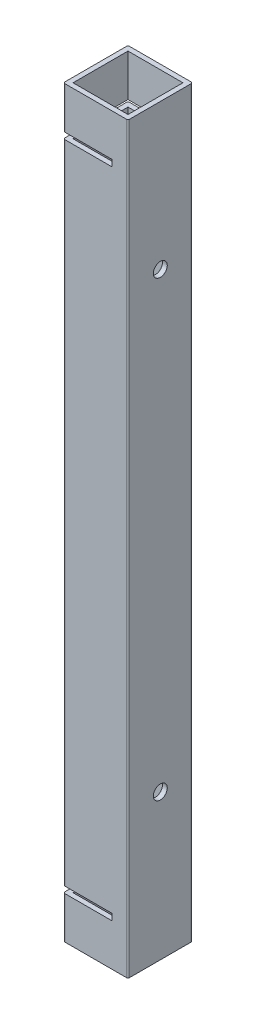
ISO-10303-21;
HEADER;
FILE_DESCRIPTION(('STEP AP214'),'2;1');
FILE_NAME('part.step','',(''),(''),'','','');
FILE_SCHEMA(('AUTOMOTIVE_DESIGN { 1 0 10303 214 1 1 1 1 }'));
ENDSEC;
DATA;
#1=APPLICATION_CONTEXT('core data for automotive mechanical design processes');
#2=APPLICATION_PROTOCOL_DEFINITION('international standard','automotive_design',2000,#1);
#3=PRODUCT_CONTEXT('',#1,'mechanical');
#4=PRODUCT('Part','Part','',(#3));
#5=PRODUCT_RELATED_PRODUCT_CATEGORY('part','',(#4));
#6=PRODUCT_DEFINITION_FORMATION('','',#4);
#7=PRODUCT_DEFINITION_CONTEXT('part definition',#1,'design');
#8=PRODUCT_DEFINITION('design','',#6,#7);
#9=PRODUCT_DEFINITION_SHAPE('','',#8);
#10=(LENGTH_UNIT() NAMED_UNIT(*) SI_UNIT(.MILLI.,.METRE.));
#11=(NAMED_UNIT(*) PLANE_ANGLE_UNIT() SI_UNIT($,.RADIAN.));
#12=(NAMED_UNIT(*) SI_UNIT($,.STERADIAN.) SOLID_ANGLE_UNIT());
#13=UNCERTAINTY_MEASURE_WITH_UNIT(LENGTH_MEASURE(1.E-05),#10,'distance_accuracy_value','');
#14=(GEOMETRIC_REPRESENTATION_CONTEXT(3) GLOBAL_UNCERTAINTY_ASSIGNED_CONTEXT((#13)) GLOBAL_UNIT_ASSIGNED_CONTEXT((#10,
#11,#12)) REPRESENTATION_CONTEXT('',''));
#15=CARTESIAN_POINT('',(0.,0.,0.));
#16=DIRECTION('',(0.,0.,1.));
#17=DIRECTION('',(1.,0.,0.));
#18=AXIS2_PLACEMENT_3D('',#15,#16,#17);
#19=CARTESIAN_POINT('',(0.5,230.,-19.5));
#20=DIRECTION('',(0.,-1.,0.));
#21=DIRECTION('',(0.,0.,-1.));
#22=AXIS2_PLACEMENT_3D('',#19,#20,#21);
#23=CYLINDRICAL_SURFACE('',#22,0.5);
#24=DIRECTION('',(0.,-1.,0.));
#25=VECTOR('',#24,1.);
#26=CARTESIAN_POINT('',(0.,230.,-19.5));
#27=LINE('',#26,#25);
#28=CARTESIAN_POINT('',(0.,13.,-19.5));
#29=VERTEX_POINT('',#28);
#30=CARTESIAN_POINT('',(0.,0.,-19.5));
#31=VERTEX_POINT('',#30);
#32=EDGE_CURVE('E503',#29,#31,#27,.T.);
#33=ORIENTED_EDGE('',*,*,#32,.F.);
#34=CARTESIAN_POINT('',(0.5,13.,-19.5));
#35=DIRECTION('',(0.,-1.,0.));
#36=DIRECTION('',(0.,0.,-1.));
#37=AXIS2_PLACEMENT_3D('',#34,#35,#36);
#38=CIRCLE('',#37,0.5);
#39=CARTESIAN_POINT('',(0.5,13.,-20.));
#40=VERTEX_POINT('',#39);
#41=EDGE_CURVE('E384',#29,#40,#38,.T.);
#42=ORIENTED_EDGE('',*,*,#41,.T.);
#43=DIRECTION('',(0.,-1.,0.));
#44=VECTOR('',#43,1.);
#45=CARTESIAN_POINT('',(0.5,230.,-20.));
#46=LINE('',#45,#44);
#47=CARTESIAN_POINT('',(0.5,0.,-20.));
#48=VERTEX_POINT('',#47);
#49=EDGE_CURVE('E509',#40,#48,#46,.T.);
#50=ORIENTED_EDGE('',*,*,#49,.T.);
#51=CARTESIAN_POINT('',(0.5,0.,-19.5));
#52=DIRECTION('',(0.,1.,0.));
#53=DIRECTION('',(0.,0.,-1.));
#54=AXIS2_PLACEMENT_3D('',#51,#52,#53);
#55=CIRCLE('',#54,0.5);
#56=EDGE_CURVE('E476',#48,#31,#55,.T.);
#57=ORIENTED_EDGE('',*,*,#56,.T.);
#58=EDGE_LOOP('',(#33,#42,#50,#57));
#59=FACE_BOUND('',#58,.T.);
#60=ADVANCED_FACE('F39',(#59),#23,.T.);
#61=CARTESIAN_POINT('',(0.5,230.,-20.));
#62=VERTEX_POINT('',#61);
#63=CARTESIAN_POINT('',(0.5,217.,-20.));
#64=VERTEX_POINT('',#63);
#65=EDGE_CURVE('E511',#62,#64,#46,.T.);
#66=ORIENTED_EDGE('',*,*,#65,.T.);
#67=CARTESIAN_POINT('',(0.5,217.,-19.5));
#68=DIRECTION('',(0.,1.,0.));
#69=DIRECTION('',(0.,0.,1.));
#70=AXIS2_PLACEMENT_3D('',#67,#68,#69);
#71=CIRCLE('',#70,0.5);
#72=CARTESIAN_POINT('',(0.,217.,-19.5));
#73=VERTEX_POINT('',#72);
#74=EDGE_CURVE('E355',#64,#73,#71,.T.);
#75=ORIENTED_EDGE('',*,*,#74,.T.);
#76=CARTESIAN_POINT('',(0.,230.,-19.5));
#77=VERTEX_POINT('',#76);
#78=EDGE_CURVE('E505',#77,#73,#27,.T.);
#79=ORIENTED_EDGE('',*,*,#78,.F.);
#80=CARTESIAN_POINT('',(0.5,230.,-19.5));
#81=DIRECTION('',(0.,1.,0.));
#82=DIRECTION('',(0.,0.,-1.));
#83=AXIS2_PLACEMENT_3D('',#80,#81,#82);
#84=CIRCLE('',#83,0.5);
#85=EDGE_CURVE('E450',#62,#77,#84,.T.);
#86=ORIENTED_EDGE('',*,*,#85,.F.);
#87=EDGE_LOOP('',(#66,#75,#79,#86));
#88=FACE_BOUND('',#87,.T.);
#89=ADVANCED_FACE('F655',(#88),#23,.T.);
#90=CARTESIAN_POINT('',(0.,230.,-0.500000000000004));
#91=DIRECTION('',(1.,0.,0.));
#92=DIRECTION('',(0.,0.,-1.));
#93=AXIS2_PLACEMENT_3D('',#90,#91,#92);
#94=PLANE('',#93);
#95=DIRECTION('',(0.,-1.,0.));
#96=VECTOR('',#95,1.);
#97=CARTESIAN_POINT('',(0.,230.,-0.500000000000003));
#98=LINE('',#97,#96);
#99=CARTESIAN_POINT('',(0.,13.,-0.5));
#100=VERTEX_POINT('',#99);
#101=CARTESIAN_POINT('',(0.,0.,-0.500000000000003));
#102=VERTEX_POINT('',#101);
#103=EDGE_CURVE('E498',#100,#102,#98,.T.);
#104=ORIENTED_EDGE('',*,*,#103,.F.);
#105=DIRECTION('',(0.,0.,1.));
#106=VECTOR('',#105,1.);
#107=CARTESIAN_POINT('',(0.,13.,-20.));
#108=LINE('',#107,#106);
#109=EDGE_CURVE('E273',#29,#100,#108,.T.);
#110=ORIENTED_EDGE('',*,*,#109,.F.);
#111=ORIENTED_EDGE('',*,*,#32,.T.);
#112=DIRECTION('',(0.,0.,1.));
#113=VECTOR('',#112,1.);
#114=CARTESIAN_POINT('',(0.,0.,-0.500000000000004));
#115=LINE('',#114,#113);
#116=EDGE_CURVE('E480',#31,#102,#115,.T.);
#117=ORIENTED_EDGE('',*,*,#116,.T.);
#118=EDGE_LOOP('',(#104,#110,#111,#117));
#119=FACE_BOUND('',#118,.T.);
#120=ADVANCED_FACE('F624',(#119),#94,.F.);
#121=ORIENTED_EDGE('',*,*,#78,.T.);
#122=DIRECTION('',(0.,0.,-1.));
#123=VECTOR('',#122,1.);
#124=CARTESIAN_POINT('',(0.,217.,-20.));
#125=LINE('',#124,#123);
#126=CARTESIAN_POINT('',(0.,217.,-0.5));
#127=VERTEX_POINT('',#126);
#128=EDGE_CURVE('E309',#127,#73,#125,.T.);
#129=ORIENTED_EDGE('',*,*,#128,.F.);
#130=CARTESIAN_POINT('',(0.,230.,-0.500000000000003));
#131=VERTEX_POINT('',#130);
#132=EDGE_CURVE('E499',#131,#127,#98,.T.);
#133=ORIENTED_EDGE('',*,*,#132,.F.);
#134=DIRECTION('',(0.,0.,1.));
#135=VECTOR('',#134,1.);
#136=CARTESIAN_POINT('',(0.,230.,-0.500000000000004));
#137=LINE('',#136,#135);
#138=EDGE_CURVE('E453',#77,#131,#137,.T.);
#139=ORIENTED_EDGE('',*,*,#138,.F.);
#140=EDGE_LOOP('',(#121,#129,#133,#139));
#141=FACE_BOUND('',#140,.T.);
#142=ADVANCED_FACE('F650',(#141),#94,.F.);
#143=CARTESIAN_POINT('',(0.5,230.,-0.5));
#144=DIRECTION('',(0.,-1.,0.));
#145=DIRECTION('',(0.,0.,-1.));
#146=AXIS2_PLACEMENT_3D('',#143,#144,#145);
#147=CYLINDRICAL_SURFACE('',#146,0.5);
#148=DIRECTION('',(0.,-1.,0.));
#149=VECTOR('',#148,1.);
#150=CARTESIAN_POINT('',(0.500000000000004,230.,0.));
#151=LINE('',#150,#149);
#152=CARTESIAN_POINT('',(0.500000000000004,13.,0.));
#153=VERTEX_POINT('',#152);
#154=CARTESIAN_POINT('',(0.500000000000004,0.,0.));
#155=VERTEX_POINT('',#154);
#156=EDGE_CURVE('E493',#153,#155,#151,.T.);
#157=ORIENTED_EDGE('',*,*,#156,.F.);
#158=CARTESIAN_POINT('',(0.5,13.,-0.5));
#159=DIRECTION('',(0.,-1.,0.));
#160=DIRECTION('',(0.,0.,-1.));
#161=AXIS2_PLACEMENT_3D('',#158,#159,#160);
#162=CIRCLE('',#161,0.5);
#163=EDGE_CURVE('E380',#153,#100,#162,.T.);
#164=ORIENTED_EDGE('',*,*,#163,.T.);
#165=ORIENTED_EDGE('',*,*,#103,.T.);
#166=CARTESIAN_POINT('',(0.5,0.,-0.5));
#167=DIRECTION('',(0.,1.,0.));
#168=DIRECTION('',(0.,0.,-1.));
#169=AXIS2_PLACEMENT_3D('',#166,#167,#168);
#170=CIRCLE('',#169,0.5);
#171=EDGE_CURVE('E484',#102,#155,#170,.T.);
#172=ORIENTED_EDGE('',*,*,#171,.T.);
#173=EDGE_LOOP('',(#157,#164,#165,#172));
#174=FACE_BOUND('',#173,.T.);
#175=ADVANCED_FACE('F619',(#174),#147,.T.);
#176=ORIENTED_EDGE('',*,*,#132,.T.);
#177=CARTESIAN_POINT('',(0.5,217.,-0.5));
#178=DIRECTION('',(0.,1.,0.));
#179=DIRECTION('',(0.,0.,1.));
#180=AXIS2_PLACEMENT_3D('',#177,#178,#179);
#181=CIRCLE('',#180,0.5);
#182=CARTESIAN_POINT('',(0.500000000000004,217.,0.));
#183=VERTEX_POINT('',#182);
#184=EDGE_CURVE('E351',#127,#183,#181,.T.);
#185=ORIENTED_EDGE('',*,*,#184,.T.);
#186=CARTESIAN_POINT('',(0.500000000000004,230.,0.));
#187=VERTEX_POINT('',#186);
#188=EDGE_CURVE('E494',#187,#183,#151,.T.);
#189=ORIENTED_EDGE('',*,*,#188,.F.);
#190=CARTESIAN_POINT('',(0.5,230.,-0.5));
#191=DIRECTION('',(0.,1.,0.));
#192=DIRECTION('',(0.,0.,-1.));
#193=AXIS2_PLACEMENT_3D('',#190,#191,#192);
#194=CIRCLE('',#193,0.5);
#195=EDGE_CURVE('E456',#131,#187,#194,.T.);
#196=ORIENTED_EDGE('',*,*,#195,.F.);
#197=EDGE_LOOP('',(#176,#185,#189,#196));
#198=FACE_BOUND('',#197,.T.);
#199=ADVANCED_FACE('F643',(#198),#147,.T.);
#200=CARTESIAN_POINT('',(1.5,230.,-1.5));
#201=DIRECTION('',(1.,0.,0.));
#202=DIRECTION('',(0.,0.,-1.));
#203=AXIS2_PLACEMENT_3D('',#200,#201,#202);
#204=PLANE('',#203);
#205=DIRECTION('',(0.,0.,-1.));
#206=VECTOR('',#205,1.);
#207=CARTESIAN_POINT('',(1.5,13.,-1.50000000000015));
#208=LINE('',#207,#206);
#209=CARTESIAN_POINT('',(1.5,13.,-1.5));
#210=VERTEX_POINT('',#209);
#211=CARTESIAN_POINT('',(1.5,13.,-18.5));
#212=VERTEX_POINT('',#211);
#213=EDGE_CURVE('E374',#210,#212,#208,.T.);
#214=ORIENTED_EDGE('',*,*,#213,.F.);
#215=DIRECTION('',(0.,-1.,0.));
#216=VECTOR('',#215,1.);
#217=CARTESIAN_POINT('',(1.5,230.,-1.5));
#218=LINE('',#217,#216);
#219=CARTESIAN_POINT('',(1.5,0.,-1.5));
#220=VERTEX_POINT('',#219);
#221=EDGE_CURVE('E429',#210,#220,#218,.T.);
#222=ORIENTED_EDGE('',*,*,#221,.T.);
#223=DIRECTION('',(0.,0.,1.));
#224=VECTOR('',#223,1.);
#225=CARTESIAN_POINT('',(1.5,0.,-1.5));
#226=LINE('',#225,#224);
#227=CARTESIAN_POINT('',(1.5,0.,-18.5));
#228=VERTEX_POINT('',#227);
#229=EDGE_CURVE('E388',#228,#220,#226,.T.);
#230=ORIENTED_EDGE('',*,*,#229,.F.);
#231=DIRECTION('',(0.,-1.,0.));
#232=VECTOR('',#231,1.);
#233=CARTESIAN_POINT('',(1.5,230.,-18.5));
#234=LINE('',#233,#232);
#235=EDGE_CURVE('E403',#212,#228,#234,.T.);
#236=ORIENTED_EDGE('',*,*,#235,.F.);
#237=EDGE_LOOP('',(#214,#222,#230,#236));
#238=FACE_BOUND('',#237,.T.);
#239=ADVANCED_FACE('F722',(#238),#204,.T.);
#240=DIRECTION('',(0.,0.,1.));
#241=VECTOR('',#240,1.);
#242=CARTESIAN_POINT('',(1.5,217.,-1.5));
#243=LINE('',#242,#241);
#244=CARTESIAN_POINT('',(1.5,217.,-18.5));
#245=VERTEX_POINT('',#244);
#246=CARTESIAN_POINT('',(1.5,217.,-1.5));
#247=VERTEX_POINT('',#246);
#248=EDGE_CURVE('E345',#245,#247,#243,.T.);
#249=ORIENTED_EDGE('',*,*,#248,.F.);
#250=CARTESIAN_POINT('',(1.5,230.,-18.5));
#251=VERTEX_POINT('',#250);
#252=EDGE_CURVE('E418',#251,#245,#234,.T.);
#253=ORIENTED_EDGE('',*,*,#252,.F.);
#254=DIRECTION('',(0.,0.,1.));
#255=VECTOR('',#254,1.);
#256=CARTESIAN_POINT('',(1.5,230.,-1.5));
#257=LINE('',#256,#255);
#258=CARTESIAN_POINT('',(1.5,230.,-1.5));
#259=VERTEX_POINT('',#258);
#260=EDGE_CURVE('E389',#251,#259,#257,.T.);
#261=ORIENTED_EDGE('',*,*,#260,.T.);
#262=EDGE_CURVE('E430',#259,#247,#218,.T.);
#263=ORIENTED_EDGE('',*,*,#262,.T.);
#264=EDGE_LOOP('',(#249,#253,#261,#263));
#265=FACE_BOUND('',#264,.T.);
#266=ADVANCED_FACE('F697',(#265),#204,.T.);
#267=CARTESIAN_POINT('',(19.5,230.,-0.5));
#268=DIRECTION('',(0.,1.,0.));
#269=DIRECTION('',(0.,0.,1.));
#270=AXIS2_PLACEMENT_3D('',#267,#268,#269);
#271=PLANE('',#270);
#272=CARTESIAN_POINT('',(19.5,230.,-0.5));
#273=DIRECTION('',(0.,1.,0.));
#274=DIRECTION('',(0.,0.,1.));
#275=AXIS2_PLACEMENT_3D('',#272,#273,#274);
#276=CIRCLE('',#275,0.5);
#277=CARTESIAN_POINT('',(19.5,230.,0.));
#278=VERTEX_POINT('',#277);
#279=CARTESIAN_POINT('',(20.,230.,-0.5));
#280=VERTEX_POINT('',#279);
#281=EDGE_CURVE('E436',#278,#280,#276,.T.);
#282=ORIENTED_EDGE('',*,*,#281,.T.);
#283=DIRECTION('',(0.,0.,-1.));
#284=VECTOR('',#283,1.);
#285=CARTESIAN_POINT('',(20.,230.,-0.5));
#286=LINE('',#285,#284);
#287=CARTESIAN_POINT('',(20.,230.,-19.5));
#288=VERTEX_POINT('',#287);
#289=EDGE_CURVE('E440',#280,#288,#286,.T.);
#290=ORIENTED_EDGE('',*,*,#289,.T.);
#291=CARTESIAN_POINT('',(19.5,230.,-19.5));
#292=DIRECTION('',(0.,1.,0.));
#293=DIRECTION('',(0.,0.,-1.));
#294=AXIS2_PLACEMENT_3D('',#291,#292,#293);
#295=CIRCLE('',#294,0.5);
#296=CARTESIAN_POINT('',(19.5,230.,-20.));
#297=VERTEX_POINT('',#296);
#298=EDGE_CURVE('E444',#288,#297,#295,.T.);
#299=ORIENTED_EDGE('',*,*,#298,.T.);
#300=DIRECTION('',(-1.,0.,0.));
#301=VECTOR('',#300,1.);
#302=CARTESIAN_POINT('',(0.5,230.,-20.));
#303=LINE('',#302,#301);
#304=EDGE_CURVE('E447',#297,#62,#303,.T.);
#305=ORIENTED_EDGE('',*,*,#304,.T.);
#306=ORIENTED_EDGE('',*,*,#85,.T.);
#307=ORIENTED_EDGE('',*,*,#138,.T.);
#308=ORIENTED_EDGE('',*,*,#195,.T.);
#309=DIRECTION('',(1.,0.,0.));
#310=VECTOR('',#309,1.);
#311=CARTESIAN_POINT('',(0.500000000000004,230.,0.));
#312=LINE('',#311,#310);
#313=EDGE_CURVE('E459',#187,#278,#312,.T.);
#314=ORIENTED_EDGE('',*,*,#313,.T.);
#315=EDGE_LOOP('',(#282,#290,#299,#305,#306,#307,#308,#314));
#316=FACE_BOUND('',#315,.T.);
#317=DIRECTION('',(1.,0.,0.));
#318=VECTOR('',#317,1.);
#319=CARTESIAN_POINT('',(1.5,230.,-1.5));
#320=LINE('',#319,#318);
#321=CARTESIAN_POINT('',(18.5,230.,-1.5));
#322=VERTEX_POINT('',#321);
#323=EDGE_CURVE('E392',#259,#322,#320,.T.);
#324=ORIENTED_EDGE('',*,*,#323,.F.);
#325=ORIENTED_EDGE('',*,*,#260,.F.);
#326=DIRECTION('',(-1.,0.,0.));
#327=VECTOR('',#326,1.);
#328=CARTESIAN_POINT('',(1.5,230.,-18.5));
#329=LINE('',#328,#327);
#330=CARTESIAN_POINT('',(18.5,230.,-18.5));
#331=VERTEX_POINT('',#330);
#332=EDGE_CURVE('E400',#331,#251,#329,.T.);
#333=ORIENTED_EDGE('',*,*,#332,.F.);
#334=DIRECTION('',(0.,0.,-1.));
#335=VECTOR('',#334,1.);
#336=CARTESIAN_POINT('',(18.5,230.,-1.5));
#337=LINE('',#336,#335);
#338=EDGE_CURVE('E396',#322,#331,#337,.T.);
#339=ORIENTED_EDGE('',*,*,#338,.F.);
#340=EDGE_LOOP('',(#324,#325,#333,#339));
#341=FACE_BOUND('',#340,.T.);
#342=ADVANCED_FACE('F635',(#316,#341),#271,.T.);
#343=CARTESIAN_POINT('',(19.5,0.,-0.5));
#344=DIRECTION('',(0.,1.,0.));
#345=DIRECTION('',(0.,0.,1.));
#346=AXIS2_PLACEMENT_3D('',#343,#344,#345);
#347=PLANE('',#346);
#348=CARTESIAN_POINT('',(19.5,0.,-0.5));
#349=DIRECTION('',(0.,1.,0.));
#350=DIRECTION('',(0.,0.,1.));
#351=AXIS2_PLACEMENT_3D('',#348,#349,#350);
#352=CIRCLE('',#351,0.5);
#353=CARTESIAN_POINT('',(19.5,0.,0.));
#354=VERTEX_POINT('',#353);
#355=CARTESIAN_POINT('',(20.,0.,-0.5));
#356=VERTEX_POINT('',#355);
#357=EDGE_CURVE('E434',#354,#356,#352,.T.);
#358=ORIENTED_EDGE('',*,*,#357,.F.);
#359=DIRECTION('',(1.,0.,0.));
#360=VECTOR('',#359,1.);
#361=CARTESIAN_POINT('',(0.500000000000004,0.,0.));
#362=LINE('',#361,#360);
#363=EDGE_CURVE('E441',#155,#354,#362,.T.);
#364=ORIENTED_EDGE('',*,*,#363,.F.);
#365=ORIENTED_EDGE('',*,*,#171,.F.);
#366=ORIENTED_EDGE('',*,*,#116,.F.);
#367=ORIENTED_EDGE('',*,*,#56,.F.);
#368=DIRECTION('',(-1.,0.,0.));
#369=VECTOR('',#368,1.);
#370=CARTESIAN_POINT('',(0.5,0.,-20.));
#371=LINE('',#370,#369);
#372=CARTESIAN_POINT('',(19.5,0.,-20.));
#373=VERTEX_POINT('',#372);
#374=EDGE_CURVE('E472',#373,#48,#371,.T.);
#375=ORIENTED_EDGE('',*,*,#374,.F.);
#376=CARTESIAN_POINT('',(19.5,0.,-19.5));
#377=DIRECTION('',(0.,1.,0.));
#378=DIRECTION('',(0.,0.,-1.));
#379=AXIS2_PLACEMENT_3D('',#376,#377,#378);
#380=CIRCLE('',#379,0.5);
#381=CARTESIAN_POINT('',(20.,0.,-19.5));
#382=VERTEX_POINT('',#381);
#383=EDGE_CURVE('E469',#382,#373,#380,.T.);
#384=ORIENTED_EDGE('',*,*,#383,.F.);
#385=DIRECTION('',(0.,0.,-1.));
#386=VECTOR('',#385,1.);
#387=CARTESIAN_POINT('',(20.,0.,-0.5));
#388=LINE('',#387,#386);
#389=EDGE_CURVE('E466',#356,#382,#388,.T.);
#390=ORIENTED_EDGE('',*,*,#389,.F.);
#391=EDGE_LOOP('',(#358,#364,#365,#366,#367,#375,#384,#390));
#392=FACE_BOUND('',#391,.T.);
#393=ORIENTED_EDGE('',*,*,#229,.T.);
#394=DIRECTION('',(1.,0.,0.));
#395=VECTOR('',#394,1.);
#396=CARTESIAN_POINT('',(1.5,0.,-1.5));
#397=LINE('',#396,#395);
#398=CARTESIAN_POINT('',(18.5,0.,-1.5));
#399=VERTEX_POINT('',#398);
#400=EDGE_CURVE('E407',#220,#399,#397,.T.);
#401=ORIENTED_EDGE('',*,*,#400,.T.);
#402=DIRECTION('',(0.,0.,-1.));
#403=VECTOR('',#402,1.);
#404=CARTESIAN_POINT('',(18.5,0.,-1.5));
#405=LINE('',#404,#403);
#406=CARTESIAN_POINT('',(18.5,0.,-18.5));
#407=VERTEX_POINT('',#406);
#408=EDGE_CURVE('E411',#399,#407,#405,.T.);
#409=ORIENTED_EDGE('',*,*,#408,.T.);
#410=DIRECTION('',(-1.,0.,0.));
#411=VECTOR('',#410,1.);
#412=CARTESIAN_POINT('',(1.5,0.,-18.5));
#413=LINE('',#412,#411);
#414=EDGE_CURVE('E393',#407,#228,#413,.T.);
#415=ORIENTED_EDGE('',*,*,#414,.T.);
#416=EDGE_LOOP('',(#393,#401,#409,#415));
#417=FACE_BOUND('',#416,.T.);
#418=ADVANCED_FACE('F627',(#392,#417),#347,.F.);
#419=CARTESIAN_POINT('',(19.5,230.,-0.5));
#420=DIRECTION('',(0.,-1.,0.));
#421=DIRECTION('',(0.,0.,-1.));
#422=AXIS2_PLACEMENT_3D('',#419,#420,#421);
#423=CYLINDRICAL_SURFACE('',#422,0.5);
#424=ORIENTED_EDGE('',*,*,#357,.T.);
#425=DIRECTION('',(0.,-1.,0.));
#426=VECTOR('',#425,1.);
#427=CARTESIAN_POINT('',(20.,230.,-0.5));
#428=LINE('',#427,#426);
#429=EDGE_CURVE('E524',#280,#356,#428,.T.);
#430=ORIENTED_EDGE('',*,*,#429,.F.);
#431=ORIENTED_EDGE('',*,*,#281,.F.);
#432=DIRECTION('',(0.,-1.,0.));
#433=VECTOR('',#432,1.);
#434=CARTESIAN_POINT('',(19.5,230.,0.));
#435=LINE('',#434,#433);
#436=EDGE_CURVE('E462',#278,#354,#435,.T.);
#437=ORIENTED_EDGE('',*,*,#436,.T.);
#438=EDGE_LOOP('',(#424,#430,#431,#437));
#439=FACE_BOUND('',#438,.T.);
#440=ADVANCED_FACE('F41',(#439),#423,.T.);
#441=CARTESIAN_POINT('',(20.,230.,-0.5));
#442=DIRECTION('',(-1.,0.,0.));
#443=DIRECTION('',(0.,0.,1.));
#444=AXIS2_PLACEMENT_3D('',#441,#442,#443);
#445=PLANE('',#444);
#446=CARTESIAN_POINT('',(20.,185.,-10.));
#447=DIRECTION('',(1.,0.,0.));
#448=DIRECTION('',(0.,0.,-1.));
#449=AXIS2_PLACEMENT_3D('',#446,#447,#448);
#450=CIRCLE('',#449,2.15000000000001);
#451=CARTESIAN_POINT('',(20.,185.,-12.15));
#452=VERTEX_POINT('',#451);
#453=EDGE_CURVE('E555',#452,#452,#450,.T.);
#454=ORIENTED_EDGE('',*,*,#453,.F.);
#455=EDGE_LOOP('',(#454));
#456=FACE_BOUND('',#455,.T.);
#457=CARTESIAN_POINT('',(20.,45.,-10.));
#458=DIRECTION('',(1.,0.,0.));
#459=DIRECTION('',(0.,0.,1.));
#460=AXIS2_PLACEMENT_3D('',#457,#458,#459);
#461=CIRCLE('',#460,2.15000000000001);
#462=CARTESIAN_POINT('',(20.,45.,-7.84999999999999));
#463=VERTEX_POINT('',#462);
#464=EDGE_CURVE('E567',#463,#463,#461,.T.);
#465=ORIENTED_EDGE('',*,*,#464,.F.);
#466=EDGE_LOOP('',(#465));
#467=FACE_BOUND('',#466,.T.);
#468=ORIENTED_EDGE('',*,*,#389,.T.);
#469=DIRECTION('',(0.,-1.,0.));
#470=VECTOR('',#469,1.);
#471=CARTESIAN_POINT('',(20.,230.,-19.5));
#472=LINE('',#471,#470);
#473=EDGE_CURVE('E520',#288,#382,#472,.T.);
#474=ORIENTED_EDGE('',*,*,#473,.F.);
#475=ORIENTED_EDGE('',*,*,#289,.F.);
#476=ORIENTED_EDGE('',*,*,#429,.T.);
#477=EDGE_LOOP('',(#468,#474,#475,#476));
#478=FACE_BOUND('',#477,.T.);
#479=ADVANCED_FACE('F753',(#456,#467,#478),#445,.F.);
#480=CARTESIAN_POINT('',(19.5,230.,-19.5));
#481=DIRECTION('',(0.,-1.,0.));
#482=DIRECTION('',(0.,0.,-1.));
#483=AXIS2_PLACEMENT_3D('',#480,#481,#482);
#484=CYLINDRICAL_SURFACE('',#483,0.5);
#485=ORIENTED_EDGE('',*,*,#383,.T.);
#486=DIRECTION('',(0.,-1.,0.));
#487=VECTOR('',#486,1.);
#488=CARTESIAN_POINT('',(19.5,230.,-20.));
#489=LINE('',#488,#487);
#490=EDGE_CURVE('E515',#297,#373,#489,.T.);
#491=ORIENTED_EDGE('',*,*,#490,.F.);
#492=ORIENTED_EDGE('',*,*,#298,.F.);
#493=ORIENTED_EDGE('',*,*,#473,.T.);
#494=EDGE_LOOP('',(#485,#491,#492,#493));
#495=FACE_BOUND('',#494,.T.);
#496=ADVANCED_FACE('F749',(#495),#484,.T.);
#497=CARTESIAN_POINT('',(0.5,230.,-20.));
#498=DIRECTION('',(0.,0.,1.));
#499=DIRECTION('',(1.,0.,0.));
#500=AXIS2_PLACEMENT_3D('',#497,#498,#499);
#501=PLANE('',#500);
#502=ORIENTED_EDGE('',*,*,#49,.F.);
#503=DIRECTION('',(-1.,0.,0.));
#504=VECTOR('',#503,1.);
#505=CARTESIAN_POINT('',(15.,13.,-20.));
#506=LINE('',#505,#504);
#507=CARTESIAN_POINT('',(15.,13.,-20.));
#508=VERTEX_POINT('',#507);
#509=EDGE_CURVE('E286',#508,#40,#506,.T.);
#510=ORIENTED_EDGE('',*,*,#509,.F.);
#511=DIRECTION('',(0.,-1.,0.));
#512=VECTOR('',#511,1.);
#513=CARTESIAN_POINT('',(15.,15.,-20.));
#514=LINE('',#513,#512);
#515=CARTESIAN_POINT('',(15.,15.,-20.));
#516=VERTEX_POINT('',#515);
#517=EDGE_CURVE('E264',#516,#508,#514,.T.);
#518=ORIENTED_EDGE('',*,*,#517,.F.);
#519=DIRECTION('',(-1.,0.,0.));
#520=VECTOR('',#519,1.);
#521=CARTESIAN_POINT('',(15.,15.,-20.));
#522=LINE('',#521,#520);
#523=CARTESIAN_POINT('',(0.5,15.,-20.));
#524=VERTEX_POINT('',#523);
#525=EDGE_CURVE('E280',#516,#524,#522,.T.);
#526=ORIENTED_EDGE('',*,*,#525,.T.);
#527=CARTESIAN_POINT('',(0.5,215.,-20.));
#528=VERTEX_POINT('',#527);
#529=EDGE_CURVE('E516',#528,#524,#46,.T.);
#530=ORIENTED_EDGE('',*,*,#529,.F.);
#531=DIRECTION('',(-1.,0.,0.));
#532=VECTOR('',#531,1.);
#533=CARTESIAN_POINT('',(15.,215.,-20.));
#534=LINE('',#533,#532);
#535=CARTESIAN_POINT('',(15.,215.,-20.));
#536=VERTEX_POINT('',#535);
#537=EDGE_CURVE('E322',#536,#528,#534,.T.);
#538=ORIENTED_EDGE('',*,*,#537,.F.);
#539=DIRECTION('',(0.,-1.,0.));
#540=VECTOR('',#539,1.);
#541=CARTESIAN_POINT('',(15.,215.,-20.));
#542=LINE('',#541,#540);
#543=CARTESIAN_POINT('',(15.,217.,-20.));
#544=VERTEX_POINT('',#543);
#545=EDGE_CURVE('E295',#544,#536,#542,.T.);
#546=ORIENTED_EDGE('',*,*,#545,.F.);
#547=DIRECTION('',(-1.,0.,0.));
#548=VECTOR('',#547,1.);
#549=CARTESIAN_POINT('',(15.,217.,-20.));
#550=LINE('',#549,#548);
#551=EDGE_CURVE('E308',#544,#64,#550,.T.);
#552=ORIENTED_EDGE('',*,*,#551,.T.);
#553=ORIENTED_EDGE('',*,*,#65,.F.);
#554=ORIENTED_EDGE('',*,*,#304,.F.);
#555=ORIENTED_EDGE('',*,*,#490,.T.);
#556=ORIENTED_EDGE('',*,*,#374,.T.);
#557=EDGE_LOOP('',(#502,#510,#518,#526,#530,#538,#546,#552,#553,#554,#555,#556));
#558=FACE_BOUND('',#557,.T.);
#559=ADVANCED_FACE('F591',(#558),#501,.F.);
#560=ORIENTED_EDGE('',*,*,#529,.T.);
#561=CARTESIAN_POINT('',(0.5,15.,-19.5));
#562=DIRECTION('',(0.,1.,0.));
#563=DIRECTION('',(0.,0.,1.));
#564=AXIS2_PLACEMENT_3D('',#561,#562,#563);
#565=CIRCLE('',#564,0.5);
#566=CARTESIAN_POINT('',(0.,15.,-19.5));
#567=VERTEX_POINT('',#566);
#568=EDGE_CURVE('E370',#524,#567,#565,.T.);
#569=ORIENTED_EDGE('',*,*,#568,.T.);
#570=CARTESIAN_POINT('',(0.,215.,-19.5));
#571=VERTEX_POINT('',#570);
#572=EDGE_CURVE('E510',#571,#567,#27,.T.);
#573=ORIENTED_EDGE('',*,*,#572,.F.);
#574=CARTESIAN_POINT('',(0.5,215.,-19.5));
#575=DIRECTION('',(0.,-1.,0.));
#576=DIRECTION('',(0.,0.,-1.));
#577=AXIS2_PLACEMENT_3D('',#574,#575,#576);
#578=CIRCLE('',#577,0.5);
#579=EDGE_CURVE('E341',#571,#528,#578,.T.);
#580=ORIENTED_EDGE('',*,*,#579,.T.);
#581=EDGE_LOOP('',(#560,#569,#573,#580));
#582=FACE_BOUND('',#581,.T.);
#583=ADVANCED_FACE('F599',(#582),#23,.T.);
#584=CARTESIAN_POINT('',(0.,185.,-10.));
#585=DIRECTION('',(1.,0.,0.));
#586=DIRECTION('',(0.,0.,-1.));
#587=AXIS2_PLACEMENT_3D('',#584,#585,#586);
#588=CIRCLE('',#587,2.15000000000001);
#589=CARTESIAN_POINT('',(0.,185.,-12.15));
#590=VERTEX_POINT('',#589);
#591=EDGE_CURVE('E547',#590,#590,#588,.T.);
#592=ORIENTED_EDGE('',*,*,#591,.T.);
#593=EDGE_LOOP('',(#592));
#594=FACE_BOUND('',#593,.T.);
#595=CARTESIAN_POINT('',(0.,45.,-10.));
#596=DIRECTION('',(1.,0.,0.));
#597=DIRECTION('',(0.,0.,1.));
#598=AXIS2_PLACEMENT_3D('',#595,#596,#597);
#599=CIRCLE('',#598,2.15000000000001);
#600=CARTESIAN_POINT('',(0.,45.,-7.84999999999999));
#601=VERTEX_POINT('',#600);
#602=EDGE_CURVE('E561',#601,#601,#599,.T.);
#603=ORIENTED_EDGE('',*,*,#602,.T.);
#604=EDGE_LOOP('',(#603));
#605=FACE_BOUND('',#604,.T.);
#606=ORIENTED_EDGE('',*,*,#572,.T.);
#607=DIRECTION('',(0.,0.,-1.));
#608=VECTOR('',#607,1.);
#609=CARTESIAN_POINT('',(0.,15.,0.));
#610=LINE('',#609,#608);
#611=CARTESIAN_POINT('',(0.,15.,-0.5));
#612=VERTEX_POINT('',#611);
#613=EDGE_CURVE('E319',#612,#567,#610,.T.);
#614=ORIENTED_EDGE('',*,*,#613,.F.);
#615=CARTESIAN_POINT('',(0.,215.,-0.5));
#616=VERTEX_POINT('',#615);
#617=EDGE_CURVE('E504',#616,#612,#98,.T.);
#618=ORIENTED_EDGE('',*,*,#617,.F.);
#619=DIRECTION('',(0.,0.,1.));
#620=VECTOR('',#619,1.);
#621=CARTESIAN_POINT('',(0.,215.,0.));
#622=LINE('',#621,#620);
#623=EDGE_CURVE('E312',#571,#616,#622,.T.);
#624=ORIENTED_EDGE('',*,*,#623,.F.);
#625=EDGE_LOOP('',(#606,#614,#618,#624));
#626=FACE_BOUND('',#625,.T.);
#627=ADVANCED_FACE('F610',(#594,#605,#626),#94,.F.);
#628=ORIENTED_EDGE('',*,*,#617,.T.);
#629=CARTESIAN_POINT('',(0.5,15.,-0.5));
#630=DIRECTION('',(0.,1.,0.));
#631=DIRECTION('',(0.,0.,1.));
#632=AXIS2_PLACEMENT_3D('',#629,#630,#631);
#633=CIRCLE('',#632,0.5);
#634=CARTESIAN_POINT('',(0.500000000000004,15.,0.));
#635=VERTEX_POINT('',#634);
#636=EDGE_CURVE('E367',#612,#635,#633,.T.);
#637=ORIENTED_EDGE('',*,*,#636,.T.);
#638=CARTESIAN_POINT('',(0.500000000000004,215.,0.));
#639=VERTEX_POINT('',#638);
#640=EDGE_CURVE('E278',#639,#635,#151,.T.);
#641=ORIENTED_EDGE('',*,*,#640,.F.);
#642=CARTESIAN_POINT('',(0.5,215.,-0.5));
#643=DIRECTION('',(0.,-1.,0.));
#644=DIRECTION('',(0.,0.,-1.));
#645=AXIS2_PLACEMENT_3D('',#642,#643,#644);
#646=CIRCLE('',#645,0.5);
#647=EDGE_CURVE('E337',#639,#616,#646,.T.);
#648=ORIENTED_EDGE('',*,*,#647,.T.);
#649=EDGE_LOOP('',(#628,#637,#641,#648));
#650=FACE_BOUND('',#649,.T.);
#651=ADVANCED_FACE('F613',(#650),#147,.T.);
#652=CARTESIAN_POINT('',(0.500000000000004,230.,0.));
#653=DIRECTION('',(0.,0.,-1.));
#654=DIRECTION('',(-1.,0.,0.));
#655=AXIS2_PLACEMENT_3D('',#652,#653,#654);
#656=PLANE('',#655);
#657=DIRECTION('',(0.,1.,0.));
#658=VECTOR('',#657,1.);
#659=CARTESIAN_POINT('',(15.,13.,0.));
#660=LINE('',#659,#658);
#661=CARTESIAN_POINT('',(15.,13.,0.));
#662=VERTEX_POINT('',#661);
#663=CARTESIAN_POINT('',(15.,15.,0.));
#664=VERTEX_POINT('',#663);
#665=EDGE_CURVE('E268',#662,#664,#660,.T.);
#666=ORIENTED_EDGE('',*,*,#665,.F.);
#667=DIRECTION('',(-1.,0.,0.));
#668=VECTOR('',#667,1.);
#669=CARTESIAN_POINT('',(15.,13.,0.));
#670=LINE('',#669,#668);
#671=EDGE_CURVE('E57',#662,#153,#670,.T.);
#672=ORIENTED_EDGE('',*,*,#671,.T.);
#673=ORIENTED_EDGE('',*,*,#156,.T.);
#674=ORIENTED_EDGE('',*,*,#363,.T.);
#675=ORIENTED_EDGE('',*,*,#436,.F.);
#676=ORIENTED_EDGE('',*,*,#313,.F.);
#677=ORIENTED_EDGE('',*,*,#188,.T.);
#678=DIRECTION('',(-1.,0.,0.));
#679=VECTOR('',#678,1.);
#680=CARTESIAN_POINT('',(15.,217.,0.));
#681=LINE('',#680,#679);
#682=CARTESIAN_POINT('',(15.,217.,0.));
#683=VERTEX_POINT('',#682);
#684=EDGE_CURVE('E316',#683,#183,#681,.T.);
#685=ORIENTED_EDGE('',*,*,#684,.F.);
#686=DIRECTION('',(0.,1.,0.));
#687=VECTOR('',#686,1.);
#688=CARTESIAN_POINT('',(15.,217.,0.));
#689=LINE('',#688,#687);
#690=CARTESIAN_POINT('',(15.,215.,0.));
#691=VERTEX_POINT('',#690);
#692=EDGE_CURVE('E304',#691,#683,#689,.T.);
#693=ORIENTED_EDGE('',*,*,#692,.F.);
#694=DIRECTION('',(-1.,0.,0.));
#695=VECTOR('',#694,1.);
#696=CARTESIAN_POINT('',(15.,215.,0.));
#697=LINE('',#696,#695);
#698=EDGE_CURVE('E65',#691,#639,#697,.T.);
#699=ORIENTED_EDGE('',*,*,#698,.T.);
#700=ORIENTED_EDGE('',*,*,#640,.T.);
#701=DIRECTION('',(-1.,0.,0.));
#702=VECTOR('',#701,1.);
#703=CARTESIAN_POINT('',(15.,15.,0.));
#704=LINE('',#703,#702);
#705=EDGE_CURVE('E257',#664,#635,#704,.T.);
#706=ORIENTED_EDGE('',*,*,#705,.F.);
#707=EDGE_LOOP('',(#666,#672,#673,#674,#675,#676,#677,#685,#693,#699,#700,#706));
#708=FACE_BOUND('',#707,.T.);
#709=ADVANCED_FACE('F276',(#708),#656,.F.);
#710=CARTESIAN_POINT('',(1.5,185.,-10.));
#711=DIRECTION('',(1.,0.,0.));
#712=DIRECTION('',(0.,0.,-1.));
#713=AXIS2_PLACEMENT_3D('',#710,#711,#712);
#714=CIRCLE('',#713,2.15000000000001);
#715=CARTESIAN_POINT('',(1.5,185.,-12.15));
#716=VERTEX_POINT('',#715);
#717=EDGE_CURVE('E313',#716,#716,#714,.T.);
#718=ORIENTED_EDGE('',*,*,#717,.F.);
#719=EDGE_LOOP('',(#718));
#720=FACE_BOUND('',#719,.T.);
#721=CARTESIAN_POINT('',(1.5,45.,-10.));
#722=DIRECTION('',(1.,0.,0.));
#723=DIRECTION('',(0.,0.,-1.));
#724=AXIS2_PLACEMENT_3D('',#721,#722,#723);
#725=CIRCLE('',#724,2.15000000000001);
#726=CARTESIAN_POINT('',(1.5,45.,-12.15));
#727=VERTEX_POINT('',#726);
#728=EDGE_CURVE('E546',#727,#727,#725,.T.);
#729=ORIENTED_EDGE('',*,*,#728,.F.);
#730=EDGE_LOOP('',(#729));
#731=FACE_BOUND('',#730,.T.);
#732=DIRECTION('',(0.,0.,1.));
#733=VECTOR('',#732,1.);
#734=CARTESIAN_POINT('',(1.5,15.,-1.50000000000013));
#735=LINE('',#734,#733);
#736=CARTESIAN_POINT('',(1.5,15.,-18.5));
#737=VERTEX_POINT('',#736);
#738=CARTESIAN_POINT('',(1.5,15.,-1.5));
#739=VERTEX_POINT('',#738);
#740=EDGE_CURVE('E362',#737,#739,#735,.T.);
#741=ORIENTED_EDGE('',*,*,#740,.F.);
#742=CARTESIAN_POINT('',(1.5,215.,-18.5));
#743=VERTEX_POINT('',#742);
#744=EDGE_CURVE('E423',#743,#737,#234,.T.);
#745=ORIENTED_EDGE('',*,*,#744,.F.);
#746=DIRECTION('',(0.,0.,-1.));
#747=VECTOR('',#746,1.);
#748=CARTESIAN_POINT('',(1.5,215.,-1.49999999999998));
#749=LINE('',#748,#747);
#750=CARTESIAN_POINT('',(1.5,215.,-1.5));
#751=VERTEX_POINT('',#750);
#752=EDGE_CURVE('E331',#751,#743,#749,.T.);
#753=ORIENTED_EDGE('',*,*,#752,.F.);
#754=EDGE_CURVE('E435',#751,#739,#218,.T.);
#755=ORIENTED_EDGE('',*,*,#754,.T.);
#756=EDGE_LOOP('',(#741,#745,#753,#755));
#757=FACE_BOUND('',#756,.T.);
#758=ADVANCED_FACE('F717',(#720,#731,#757),#204,.T.);
#759=CARTESIAN_POINT('',(1.5,230.,-1.5));
#760=DIRECTION('',(0.,0.,-1.));
#761=DIRECTION('',(-1.,0.,0.));
#762=AXIS2_PLACEMENT_3D('',#759,#760,#761);
#763=PLANE('',#762);
#764=DIRECTION('',(-1.,0.,0.));
#765=VECTOR('',#764,1.);
#766=CARTESIAN_POINT('',(1.5,13.,-1.5));
#767=LINE('',#766,#765);
#768=CARTESIAN_POINT('',(15.,13.,-1.5));
#769=VERTEX_POINT('',#768);
#770=EDGE_CURVE('E377',#769,#210,#767,.T.);
#771=ORIENTED_EDGE('',*,*,#770,.F.);
#772=DIRECTION('',(0.,1.,0.));
#773=VECTOR('',#772,1.);
#774=CARTESIAN_POINT('',(15.,230.,-1.5));
#775=LINE('',#774,#773);
#776=CARTESIAN_POINT('',(15.,15.,-1.5));
#777=VERTEX_POINT('',#776);
#778=EDGE_CURVE('E359',#769,#777,#775,.T.);
#779=ORIENTED_EDGE('',*,*,#778,.T.);
#780=DIRECTION('',(1.,0.,0.));
#781=VECTOR('',#780,1.);
#782=CARTESIAN_POINT('',(1.5,15.,-1.5));
#783=LINE('',#782,#781);
#784=EDGE_CURVE('E260',#739,#777,#783,.T.);
#785=ORIENTED_EDGE('',*,*,#784,.F.);
#786=ORIENTED_EDGE('',*,*,#754,.F.);
#787=DIRECTION('',(-1.,0.,0.));
#788=VECTOR('',#787,1.);
#789=CARTESIAN_POINT('',(1.5,215.,-1.5));
#790=LINE('',#789,#788);
#791=CARTESIAN_POINT('',(15.,215.,-1.5));
#792=VERTEX_POINT('',#791);
#793=EDGE_CURVE('E334',#792,#751,#790,.T.);
#794=ORIENTED_EDGE('',*,*,#793,.F.);
#795=DIRECTION('',(0.,-1.,0.));
#796=VECTOR('',#795,1.);
#797=CARTESIAN_POINT('',(15.,230.,-1.5));
#798=LINE('',#797,#796);
#799=CARTESIAN_POINT('',(15.,217.,-1.5));
#800=VERTEX_POINT('',#799);
#801=EDGE_CURVE('E328',#800,#792,#798,.T.);
#802=ORIENTED_EDGE('',*,*,#801,.F.);
#803=DIRECTION('',(1.,0.,0.));
#804=VECTOR('',#803,1.);
#805=CARTESIAN_POINT('',(1.5,217.,-1.5));
#806=LINE('',#805,#804);
#807=EDGE_CURVE('E348',#247,#800,#806,.T.);
#808=ORIENTED_EDGE('',*,*,#807,.F.);
#809=ORIENTED_EDGE('',*,*,#262,.F.);
#810=ORIENTED_EDGE('',*,*,#323,.T.);
#811=DIRECTION('',(0.,-1.,0.));
#812=VECTOR('',#811,1.);
#813=CARTESIAN_POINT('',(18.5,230.,-1.5));
#814=LINE('',#813,#812);
#815=EDGE_CURVE('E426',#322,#399,#814,.T.);
#816=ORIENTED_EDGE('',*,*,#815,.T.);
#817=ORIENTED_EDGE('',*,*,#400,.F.);
#818=ORIENTED_EDGE('',*,*,#221,.F.);
#819=EDGE_LOOP('',(#771,#779,#785,#786,#794,#802,#808,#809,#810,#816,#817,#818));
#820=FACE_BOUND('',#819,.T.);
#821=ADVANCED_FACE('F675',(#820),#763,.T.);
#822=CARTESIAN_POINT('',(18.5,230.,-1.5));
#823=DIRECTION('',(-1.,0.,0.));
#824=DIRECTION('',(0.,0.,1.));
#825=AXIS2_PLACEMENT_3D('',#822,#823,#824);
#826=PLANE('',#825);
#827=CARTESIAN_POINT('',(18.5,185.,-10.));
#828=DIRECTION('',(-1.,0.,0.));
#829=DIRECTION('',(0.,0.,1.));
#830=AXIS2_PLACEMENT_3D('',#827,#828,#829);
#831=CIRCLE('',#830,2.15000000000001);
#832=CARTESIAN_POINT('',(18.5,185.,-7.84999999999999));
#833=VERTEX_POINT('',#832);
#834=EDGE_CURVE('E43',#833,#833,#831,.T.);
#835=ORIENTED_EDGE('',*,*,#834,.F.);
#836=EDGE_LOOP('',(#835));
#837=FACE_BOUND('',#836,.T.);
#838=CARTESIAN_POINT('',(18.5,45.,-10.));
#839=DIRECTION('',(-1.,0.,0.));
#840=DIRECTION('',(0.,0.,1.));
#841=AXIS2_PLACEMENT_3D('',#838,#839,#840);
#842=CIRCLE('',#841,2.15000000000001);
#843=CARTESIAN_POINT('',(18.5,45.,-7.84999999999999));
#844=VERTEX_POINT('',#843);
#845=EDGE_CURVE('E543',#844,#844,#842,.T.);
#846=ORIENTED_EDGE('',*,*,#845,.F.);
#847=EDGE_LOOP('',(#846));
#848=FACE_BOUND('',#847,.T.);
#849=ORIENTED_EDGE('',*,*,#408,.F.);
#850=ORIENTED_EDGE('',*,*,#815,.F.);
#851=ORIENTED_EDGE('',*,*,#338,.T.);
#852=DIRECTION('',(0.,-1.,0.));
#853=VECTOR('',#852,1.);
#854=CARTESIAN_POINT('',(18.5,230.,-18.5));
#855=LINE('',#854,#853);
#856=EDGE_CURVE('E422',#331,#407,#855,.T.);
#857=ORIENTED_EDGE('',*,*,#856,.T.);
#858=EDGE_LOOP('',(#849,#850,#851,#857));
#859=FACE_BOUND('',#858,.T.);
#860=ADVANCED_FACE('F671',(#837,#848,#859),#826,.T.);
#861=CARTESIAN_POINT('',(1.5,230.,-18.5));
#862=DIRECTION('',(0.,0.,1.));
#863=DIRECTION('',(1.,0.,0.));
#864=AXIS2_PLACEMENT_3D('',#861,#862,#863);
#865=PLANE('',#864);
#866=DIRECTION('',(1.,0.,0.));
#867=VECTOR('',#866,1.);
#868=CARTESIAN_POINT('',(1.5,13.,-18.5));
#869=LINE('',#868,#867);
#870=CARTESIAN_POINT('',(15.,13.,-18.5));
#871=VERTEX_POINT('',#870);
#872=EDGE_CURVE('E11',#212,#871,#869,.T.);
#873=ORIENTED_EDGE('',*,*,#872,.F.);
#874=ORIENTED_EDGE('',*,*,#235,.T.);
#875=ORIENTED_EDGE('',*,*,#414,.F.);
#876=ORIENTED_EDGE('',*,*,#856,.F.);
#877=ORIENTED_EDGE('',*,*,#332,.T.);
#878=ORIENTED_EDGE('',*,*,#252,.T.);
#879=DIRECTION('',(-1.,0.,0.));
#880=VECTOR('',#879,1.);
#881=CARTESIAN_POINT('',(1.5,217.,-18.5));
#882=LINE('',#881,#880);
#883=CARTESIAN_POINT('',(15.,217.,-18.5));
#884=VERTEX_POINT('',#883);
#885=EDGE_CURVE('E535',#884,#245,#882,.T.);
#886=ORIENTED_EDGE('',*,*,#885,.F.);
#887=DIRECTION('',(0.,1.,0.));
#888=VECTOR('',#887,1.);
#889=CARTESIAN_POINT('',(15.,230.,-18.5));
#890=LINE('',#889,#888);
#891=CARTESIAN_POINT('',(15.,215.,-18.5));
#892=VERTEX_POINT('',#891);
#893=EDGE_CURVE('E528',#892,#884,#890,.T.);
#894=ORIENTED_EDGE('',*,*,#893,.F.);
#895=DIRECTION('',(1.,0.,0.));
#896=VECTOR('',#895,1.);
#897=CARTESIAN_POINT('',(1.5,215.,-18.5));
#898=LINE('',#897,#896);
#899=EDGE_CURVE('E531',#743,#892,#898,.T.);
#900=ORIENTED_EDGE('',*,*,#899,.F.);
#901=ORIENTED_EDGE('',*,*,#744,.T.);
#902=DIRECTION('',(-1.,0.,0.));
#903=VECTOR('',#902,1.);
#904=CARTESIAN_POINT('',(1.5,15.,-18.5));
#905=LINE('',#904,#903);
#906=CARTESIAN_POINT('',(15.,15.,-18.5));
#907=VERTEX_POINT('',#906);
#908=EDGE_CURVE('E49',#907,#737,#905,.T.);
#909=ORIENTED_EDGE('',*,*,#908,.F.);
#910=DIRECTION('',(0.,-1.,0.));
#911=VECTOR('',#910,1.);
#912=CARTESIAN_POINT('',(15.,230.,-18.5));
#913=LINE('',#912,#911);
#914=EDGE_CURVE('E538',#907,#871,#913,.T.);
#915=ORIENTED_EDGE('',*,*,#914,.T.);
#916=EDGE_LOOP('',(#873,#874,#875,#876,#877,#878,#886,#894,#900,#901,#909,#915));
#917=FACE_BOUND('',#916,.T.);
#918=ADVANCED_FACE('F674',(#917),#865,.T.);
#919=CARTESIAN_POINT('',(15.,217.,-20.));
#920=DIRECTION('',(0.,1.,0.));
#921=DIRECTION('',(0.,0.,1.));
#922=AXIS2_PLACEMENT_3D('',#919,#920,#921);
#923=PLANE('',#922);
#924=ORIENTED_EDGE('',*,*,#551,.F.);
#925=DIRECTION('',(0.,0.,-1.));
#926=VECTOR('',#925,1.);
#927=CARTESIAN_POINT('',(15.,217.,-20.));
#928=LINE('',#927,#926);
#929=EDGE_CURVE('E296',#884,#544,#928,.T.);
#930=ORIENTED_EDGE('',*,*,#929,.F.);
#931=ORIENTED_EDGE('',*,*,#885,.T.);
#932=ORIENTED_EDGE('',*,*,#248,.T.);
#933=ORIENTED_EDGE('',*,*,#807,.T.);
#934=EDGE_CURVE('E291',#683,#800,#928,.T.);
#935=ORIENTED_EDGE('',*,*,#934,.F.);
#936=ORIENTED_EDGE('',*,*,#684,.T.);
#937=ORIENTED_EDGE('',*,*,#184,.F.);
#938=ORIENTED_EDGE('',*,*,#128,.T.);
#939=ORIENTED_EDGE('',*,*,#74,.F.);
#940=EDGE_LOOP('',(#924,#930,#931,#932,#933,#935,#936,#937,#938,#939));
#941=FACE_BOUND('',#940,.T.);
#942=ADVANCED_FACE('F648',(#941),#923,.F.);
#943=CARTESIAN_POINT('',(15.,215.,0.));
#944=DIRECTION('',(0.,-1.,0.));
#945=DIRECTION('',(0.,0.,-1.));
#946=AXIS2_PLACEMENT_3D('',#943,#944,#945);
#947=PLANE('',#946);
#948=ORIENTED_EDGE('',*,*,#623,.T.);
#949=ORIENTED_EDGE('',*,*,#647,.F.);
#950=ORIENTED_EDGE('',*,*,#698,.F.);
#951=DIRECTION('',(0.,0.,1.));
#952=VECTOR('',#951,1.);
#953=CARTESIAN_POINT('',(15.,215.,0.));
#954=LINE('',#953,#952);
#955=EDGE_CURVE('E300',#792,#691,#954,.T.);
#956=ORIENTED_EDGE('',*,*,#955,.F.);
#957=ORIENTED_EDGE('',*,*,#793,.T.);
#958=ORIENTED_EDGE('',*,*,#752,.T.);
#959=ORIENTED_EDGE('',*,*,#899,.T.);
#960=EDGE_CURVE('E301',#536,#892,#954,.T.);
#961=ORIENTED_EDGE('',*,*,#960,.F.);
#962=ORIENTED_EDGE('',*,*,#537,.T.);
#963=ORIENTED_EDGE('',*,*,#579,.F.);
#964=EDGE_LOOP('',(#948,#949,#950,#956,#957,#958,#959,#961,#962,#963));
#965=FACE_BOUND('',#964,.T.);
#966=ADVANCED_FACE('F703',(#965),#947,.F.);
#967=CARTESIAN_POINT('',(15.,0.,0.));
#968=DIRECTION('',(1.,0.,0.));
#969=DIRECTION('',(0.,0.,-1.));
#970=AXIS2_PLACEMENT_3D('',#967,#968,#969);
#971=PLANE('',#970);
#972=ORIENTED_EDGE('',*,*,#801,.T.);
#973=ORIENTED_EDGE('',*,*,#955,.T.);
#974=ORIENTED_EDGE('',*,*,#692,.T.);
#975=ORIENTED_EDGE('',*,*,#934,.T.);
#976=EDGE_LOOP('',(#972,#973,#974,#975));
#977=FACE_BOUND('',#976,.T.);
#978=ADVANCED_FACE('F702',(#977),#971,.F.);
#979=ORIENTED_EDGE('',*,*,#893,.T.);
#980=ORIENTED_EDGE('',*,*,#929,.T.);
#981=ORIENTED_EDGE('',*,*,#545,.T.);
#982=ORIENTED_EDGE('',*,*,#960,.T.);
#983=EDGE_LOOP('',(#979,#980,#981,#982));
#984=FACE_BOUND('',#983,.T.);
#985=ADVANCED_FACE('F660',(#984),#971,.F.);
#986=CARTESIAN_POINT('',(15.,13.,-20.));
#987=DIRECTION('',(0.,-1.,0.));
#988=DIRECTION('',(0.,0.,-1.));
#989=AXIS2_PLACEMENT_3D('',#986,#987,#988);
#990=PLANE('',#989);
#991=ORIENTED_EDGE('',*,*,#109,.T.);
#992=ORIENTED_EDGE('',*,*,#163,.F.);
#993=ORIENTED_EDGE('',*,*,#671,.F.);
#994=DIRECTION('',(0.,0.,1.));
#995=VECTOR('',#994,1.);
#996=CARTESIAN_POINT('',(15.,13.,-20.));
#997=LINE('',#996,#995);
#998=EDGE_CURVE('E270',#769,#662,#997,.T.);
#999=ORIENTED_EDGE('',*,*,#998,.F.);
#1000=ORIENTED_EDGE('',*,*,#770,.T.);
#1001=ORIENTED_EDGE('',*,*,#213,.T.);
#1002=ORIENTED_EDGE('',*,*,#872,.T.);
#1003=EDGE_CURVE('E281',#508,#871,#997,.T.);
#1004=ORIENTED_EDGE('',*,*,#1003,.F.);
#1005=ORIENTED_EDGE('',*,*,#509,.T.);
#1006=ORIENTED_EDGE('',*,*,#41,.F.);
#1007=EDGE_LOOP('',(#991,#992,#993,#999,#1000,#1001,#1002,#1004,#1005,#1006));
#1008=FACE_BOUND('',#1007,.T.);
#1009=ADVANCED_FACE('F584',(#1008),#990,.F.);
#1010=CARTESIAN_POINT('',(15.,15.,0.));
#1011=DIRECTION('',(0.,1.,0.));
#1012=DIRECTION('',(0.,0.,1.));
#1013=AXIS2_PLACEMENT_3D('',#1010,#1011,#1012);
#1014=PLANE('',#1013);
#1015=ORIENTED_EDGE('',*,*,#525,.F.);
#1016=DIRECTION('',(0.,0.,-1.));
#1017=VECTOR('',#1016,1.);
#1018=CARTESIAN_POINT('',(15.,15.,0.));
#1019=LINE('',#1018,#1017);
#1020=EDGE_CURVE('E265',#907,#516,#1019,.T.);
#1021=ORIENTED_EDGE('',*,*,#1020,.F.);
#1022=ORIENTED_EDGE('',*,*,#908,.T.);
#1023=ORIENTED_EDGE('',*,*,#740,.T.);
#1024=ORIENTED_EDGE('',*,*,#784,.T.);
#1025=EDGE_CURVE('E252',#664,#777,#1019,.T.);
#1026=ORIENTED_EDGE('',*,*,#1025,.F.);
#1027=ORIENTED_EDGE('',*,*,#705,.T.);
#1028=ORIENTED_EDGE('',*,*,#636,.F.);
#1029=ORIENTED_EDGE('',*,*,#613,.T.);
#1030=ORIENTED_EDGE('',*,*,#568,.F.);
#1031=EDGE_LOOP('',(#1015,#1021,#1022,#1023,#1024,#1026,#1027,#1028,#1029,#1030));
#1032=FACE_BOUND('',#1031,.T.);
#1033=ADVANCED_FACE('F255',(#1032),#1014,.F.);
#1034=CARTESIAN_POINT('',(15.,0.,0.));
#1035=DIRECTION('',(-1.,0.,0.));
#1036=DIRECTION('',(0.,0.,1.));
#1037=AXIS2_PLACEMENT_3D('',#1034,#1035,#1036);
#1038=PLANE('',#1037);
#1039=ORIENTED_EDGE('',*,*,#998,.T.);
#1040=ORIENTED_EDGE('',*,*,#665,.T.);
#1041=ORIENTED_EDGE('',*,*,#1025,.T.);
#1042=ORIENTED_EDGE('',*,*,#778,.F.);
#1043=EDGE_LOOP('',(#1039,#1040,#1041,#1042));
#1044=FACE_BOUND('',#1043,.T.);
#1045=ADVANCED_FACE('F269',(#1044),#1038,.T.);
#1046=ORIENTED_EDGE('',*,*,#1020,.T.);
#1047=ORIENTED_EDGE('',*,*,#517,.T.);
#1048=ORIENTED_EDGE('',*,*,#1003,.T.);
#1049=ORIENTED_EDGE('',*,*,#914,.F.);
#1050=EDGE_LOOP('',(#1046,#1047,#1048,#1049));
#1051=FACE_BOUND('',#1050,.T.);
#1052=ADVANCED_FACE('F709',(#1051),#1038,.T.);
#1053=CARTESIAN_POINT('',(0.,45.,-10.));
#1054=DIRECTION('',(1.,0.,0.));
#1055=DIRECTION('',(0.,0.,-1.));
#1056=AXIS2_PLACEMENT_3D('',#1053,#1054,#1055);
#1057=CYLINDRICAL_SURFACE('',#1056,2.15000000000001);
#1058=ORIENTED_EDGE('',*,*,#845,.T.);
#1059=EDGE_LOOP('',(#1058));
#1060=FACE_BOUND('',#1059,.T.);
#1061=ORIENTED_EDGE('',*,*,#464,.T.);
#1062=EDGE_LOOP('',(#1061));
#1063=FACE_BOUND('',#1062,.T.);
#1064=ADVANCED_FACE('F770',(#1060,#1063),#1057,.F.);
#1065=CARTESIAN_POINT('',(0.,185.,-10.));
#1066=DIRECTION('',(1.,0.,0.));
#1067=DIRECTION('',(0.,0.,-1.));
#1068=AXIS2_PLACEMENT_3D('',#1065,#1066,#1067);
#1069=CYLINDRICAL_SURFACE('',#1068,2.15000000000001);
#1070=ORIENTED_EDGE('',*,*,#834,.T.);
#1071=EDGE_LOOP('',(#1070));
#1072=FACE_BOUND('',#1071,.T.);
#1073=ORIENTED_EDGE('',*,*,#453,.T.);
#1074=EDGE_LOOP('',(#1073));
#1075=FACE_BOUND('',#1074,.T.);
#1076=ADVANCED_FACE('F668',(#1072,#1075),#1069,.F.);
#1077=ORIENTED_EDGE('',*,*,#728,.T.);
#1078=EDGE_LOOP('',(#1077));
#1079=FACE_BOUND('',#1078,.T.);
#1080=ORIENTED_EDGE('',*,*,#602,.F.);
#1081=EDGE_LOOP('',(#1080));
#1082=FACE_BOUND('',#1081,.T.);
#1083=ADVANCED_FACE('F773',(#1079,#1082),#1057,.F.);
#1084=ORIENTED_EDGE('',*,*,#717,.T.);
#1085=EDGE_LOOP('',(#1084));
#1086=FACE_BOUND('',#1085,.T.);
#1087=ORIENTED_EDGE('',*,*,#591,.F.);
#1088=EDGE_LOOP('',(#1087));
#1089=FACE_BOUND('',#1088,.T.);
#1090=ADVANCED_FACE('F779',(#1086,#1089),#1069,.F.);
#1091=CLOSED_SHELL('',(#60,#89,#120,#142,#175,#199,#239,#266,#342,#418,#440,#479,#496,#559,#583,
#627,#651,#709,#758,#821,#860,#918,#942,#966,#978,#985,#1009,#1033,#1045,#1052,#1064,#1076,
#1083,#1090));
#1092=MANIFOLD_SOLID_BREP('B2',#1091);
#1093=ADVANCED_BREP_SHAPE_REPRESENTATION('',(#18,#1092),#14);
#1094=SHAPE_DEFINITION_REPRESENTATION(#9,#1093);
ENDSEC;
END-ISO-10303-21;
